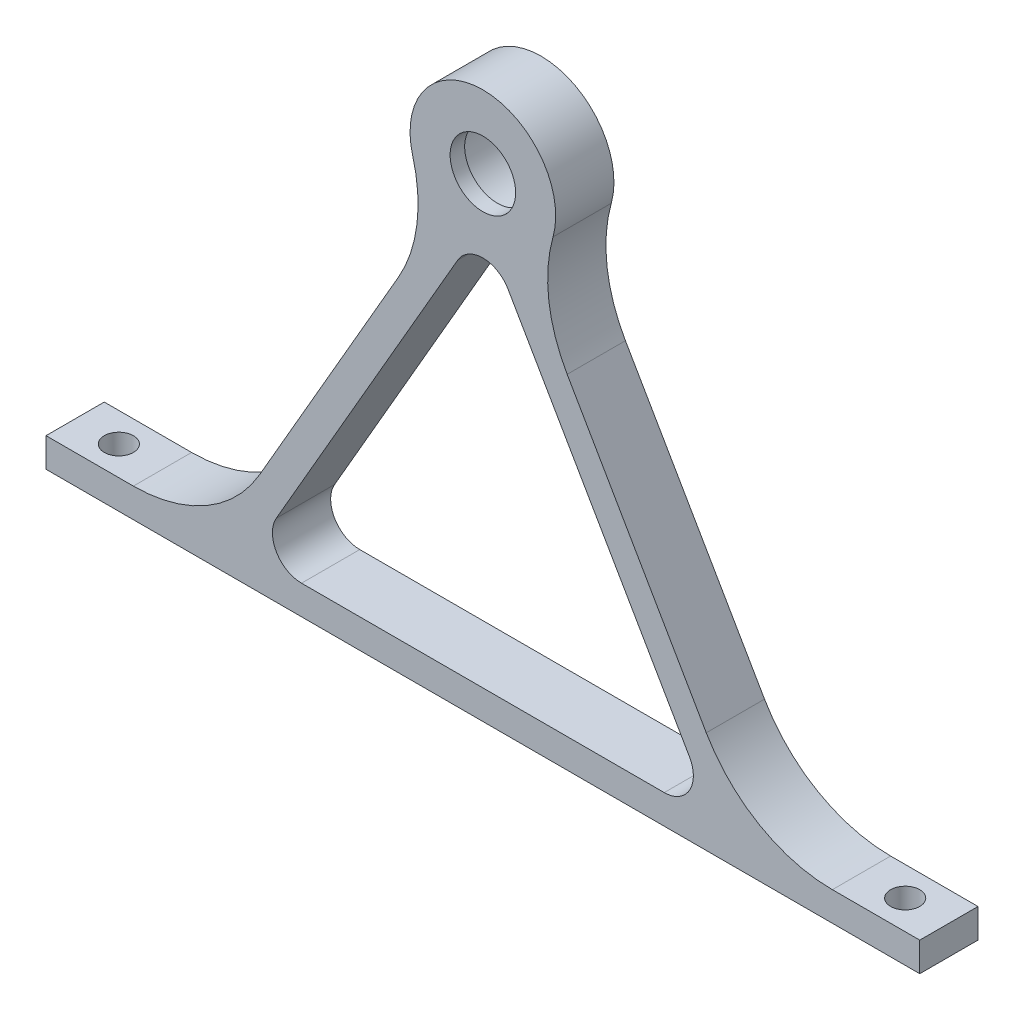
ISO-10303-21;
HEADER;
FILE_DESCRIPTION(('STEP AP214'),'2;1');
FILE_NAME('part.step','',(''),(''),'','','');
FILE_SCHEMA(('AUTOMOTIVE_DESIGN { 1 0 10303 214 1 1 1 1 }'));
ENDSEC;
DATA;
#1=APPLICATION_CONTEXT('core data for automotive mechanical design processes');
#2=APPLICATION_PROTOCOL_DEFINITION('international standard','automotive_design',2000,#1);
#3=PRODUCT_CONTEXT('',#1,'mechanical');
#4=PRODUCT('Part','Part','',(#3));
#5=PRODUCT_RELATED_PRODUCT_CATEGORY('part','',(#4));
#6=PRODUCT_DEFINITION_FORMATION('','',#4);
#7=PRODUCT_DEFINITION_CONTEXT('part definition',#1,'design');
#8=PRODUCT_DEFINITION('design','',#6,#7);
#9=PRODUCT_DEFINITION_SHAPE('','',#8);
#10=(LENGTH_UNIT() NAMED_UNIT(*) SI_UNIT(.MILLI.,.METRE.));
#11=(NAMED_UNIT(*) PLANE_ANGLE_UNIT() SI_UNIT($,.RADIAN.));
#12=(NAMED_UNIT(*) SI_UNIT($,.STERADIAN.) SOLID_ANGLE_UNIT());
#13=UNCERTAINTY_MEASURE_WITH_UNIT(LENGTH_MEASURE(1.E-05),#10,'distance_accuracy_value','');
#14=(GEOMETRIC_REPRESENTATION_CONTEXT(3) GLOBAL_UNCERTAINTY_ASSIGNED_CONTEXT((#13)) GLOBAL_UNIT_ASSIGNED_CONTEXT((#10,
#11,#12)) REPRESENTATION_CONTEXT('',''));
#15=CARTESIAN_POINT('',(0.,0.,0.));
#16=DIRECTION('',(0.,0.,1.));
#17=DIRECTION('',(1.,0.,0.));
#18=AXIS2_PLACEMENT_3D('',#15,#16,#17);
#19=CARTESIAN_POINT('',(0.,32.5692193816532,4.));
#20=DIRECTION('',(0.,0.,-1.));
#21=DIRECTION('',(-1.,0.,0.));
#22=AXIS2_PLACEMENT_3D('',#19,#20,#21);
#23=CYLINDRICAL_SURFACE('',#22,3.);
#24=CARTESIAN_POINT('',(0.,32.5692193816532,0.));
#25=DIRECTION('',(0.,0.,1.));
#26=DIRECTION('',(1.,0.,0.));
#27=AXIS2_PLACEMENT_3D('',#24,#25,#26);
#28=CIRCLE('',#27,3.);
#29=CARTESIAN_POINT('',(3.,32.5692193816532,0.));
#30=VERTEX_POINT('',#29);
#31=EDGE_CURVE('E283',#30,#30,#28,.T.);
#32=ORIENTED_EDGE('',*,*,#31,.F.);
#33=EDGE_LOOP('',(#32));
#34=FACE_BOUND('',#33,.T.);
#35=CARTESIAN_POINT('',(0.,32.5692193816532,3.));
#36=DIRECTION('',(0.,0.,1.));
#37=DIRECTION('',(1.,0.,0.));
#38=AXIS2_PLACEMENT_3D('',#35,#36,#37);
#39=CIRCLE('',#38,3.);
#40=CARTESIAN_POINT('',(3.,32.5692193816532,3.));
#41=VERTEX_POINT('',#40);
#42=EDGE_CURVE('E461',#41,#41,#39,.T.);
#43=ORIENTED_EDGE('',*,*,#42,.T.);
#44=EDGE_LOOP('',(#43));
#45=FACE_BOUND('',#44,.T.);
#46=ADVANCED_FACE('F132',(#34,#45),#23,.F.);
#47=CARTESIAN_POINT('',(24.,12.,4.));
#48=DIRECTION('',(0.,0.,-1.));
#49=DIRECTION('',(-1.,0.,0.));
#50=AXIS2_PLACEMENT_3D('',#47,#48,#49);
#51=PLANE('',#50);
#52=CARTESIAN_POINT('',(0.,25.5692193816532,4.));
#53=DIRECTION('',(0.,0.,-1.));
#54=DIRECTION('',(-1.,0.,0.));
#55=AXIS2_PLACEMENT_3D('',#52,#53,#54);
#56=CIRCLE('',#55,2.00000000000001);
#57=CARTESIAN_POINT('',(-1.73205080756888,26.5692193816532,4.));
#58=VERTEX_POINT('',#57);
#59=CARTESIAN_POINT('',(1.73205080756888,26.5692193816532,4.));
#60=VERTEX_POINT('',#59);
#61=EDGE_CURVE('E261',#58,#60,#56,.T.);
#62=ORIENTED_EDGE('',*,*,#61,.T.);
#63=DIRECTION('',(-0.499999999999997,0.86602540378444,0.));
#64=VECTOR('',#63,1.);
#65=CARTESIAN_POINT('',(14.1850454237764,5.,4.));
#66=LINE('',#65,#64);
#67=CARTESIAN_POINT('',(14.1850454237764,5.,4.));
#68=VERTEX_POINT('',#67);
#69=EDGE_CURVE('E265',#68,#60,#66,.T.);
#70=ORIENTED_EDGE('',*,*,#69,.F.);
#71=CARTESIAN_POINT('',(12.4529946162075,4.,4.));
#72=DIRECTION('',(0.,0.,1.));
#73=DIRECTION('',(1.,0.,0.));
#74=AXIS2_PLACEMENT_3D('',#71,#72,#73);
#75=CIRCLE('',#74,2.);
#76=CARTESIAN_POINT('',(12.4529946162075,2.,4.));
#77=VERTEX_POINT('',#76);
#78=EDGE_CURVE('E273',#77,#68,#75,.T.);
#79=ORIENTED_EDGE('',*,*,#78,.F.);
#80=DIRECTION('',(1.,0.,0.));
#81=VECTOR('',#80,1.);
#82=CARTESIAN_POINT('',(-12.4529946162075,2.,4.));
#83=LINE('',#82,#81);
#84=CARTESIAN_POINT('',(-12.4529946162075,2.,4.));
#85=VERTEX_POINT('',#84);
#86=EDGE_CURVE('E488',#85,#77,#83,.T.);
#87=ORIENTED_EDGE('',*,*,#86,.F.);
#88=CARTESIAN_POINT('',(-12.4529946162075,4.,4.));
#89=DIRECTION('',(0.,0.,-1.));
#90=DIRECTION('',(-1.,0.,0.));
#91=AXIS2_PLACEMENT_3D('',#88,#89,#90);
#92=CIRCLE('',#91,2.);
#93=CARTESIAN_POINT('',(-14.1850454237764,5.,4.));
#94=VERTEX_POINT('',#93);
#95=EDGE_CURVE('E279',#85,#94,#92,.T.);
#96=ORIENTED_EDGE('',*,*,#95,.T.);
#97=DIRECTION('',(-0.499999999999998,-0.86602540378444,0.));
#98=VECTOR('',#97,1.);
#99=CARTESIAN_POINT('',(-1.73205080756888,26.5692193816532,4.));
#100=LINE('',#99,#98);
#101=EDGE_CURVE('E267',#58,#94,#100,.T.);
#102=ORIENTED_EDGE('',*,*,#101,.F.);
#103=EDGE_LOOP('',(#62,#70,#79,#87,#96,#102));
#104=FACE_BOUND('',#103,.T.);
#105=CARTESIAN_POINT('',(14.4493380611437,28.5422317240134,4.));
#106=DIRECTION('',(0.,0.,-1.));
#107=DIRECTION('',(-1.,0.,0.));
#108=AXIS2_PLACEMENT_3D('',#105,#106,#107);
#109=CIRCLE('',#108,10.);
#110=CARTESIAN_POINT('',(5.78908402329934,23.5422317240135,4.));
#111=VERTEX_POINT('',#110);
#112=CARTESIAN_POINT('',(4.81644602038124,31.2268901624399,4.));
#113=VERTEX_POINT('',#112);
#114=EDGE_CURVE('E318',#111,#113,#109,.T.);
#115=ORIENTED_EDGE('',*,*,#114,.T.);
#116=CARTESIAN_POINT('',(0.,32.5692193816532,4.));
#117=DIRECTION('',(0.,0.,-1.));
#118=DIRECTION('',(-1.,0.,0.));
#119=AXIS2_PLACEMENT_3D('',#116,#117,#118);
#120=CIRCLE('',#119,5.);
#121=CARTESIAN_POINT('',(-4.81644602038125,31.2268901624399,4.));
#122=VERTEX_POINT('',#121);
#123=EDGE_CURVE('E315',#122,#113,#120,.T.);
#124=ORIENTED_EDGE('',*,*,#123,.F.);
#125=CARTESIAN_POINT('',(-14.4493380611437,28.5422317240134,4.));
#126=DIRECTION('',(0.,0.,1.));
#127=DIRECTION('',(1.,0.,0.));
#128=AXIS2_PLACEMENT_3D('',#125,#126,#127);
#129=CIRCLE('',#128,10.);
#130=CARTESIAN_POINT('',(-5.78908402329934,23.5422317240135,4.));
#131=VERTEX_POINT('',#130);
#132=EDGE_CURVE('E312',#131,#122,#129,.T.);
#133=ORIENTED_EDGE('',*,*,#132,.F.);
#134=DIRECTION('',(0.499999999999998,0.86602540378444,0.));
#135=VECTOR('',#134,1.);
#136=CARTESIAN_POINT('',(-15.3397459621556,7.00000000000002,4.));
#137=LINE('',#136,#135);
#138=CARTESIAN_POINT('',(-15.3397459621556,7.00000000000002,4.));
#139=VERTEX_POINT('',#138);
#140=EDGE_CURVE('E309',#139,#131,#137,.T.);
#141=ORIENTED_EDGE('',*,*,#140,.F.);
#142=CARTESIAN_POINT('',(-24.,12.,4.));
#143=DIRECTION('',(0.,0.,-1.));
#144=DIRECTION('',(-1.,0.,0.));
#145=AXIS2_PLACEMENT_3D('',#142,#143,#144);
#146=CIRCLE('',#145,10.);
#147=CARTESIAN_POINT('',(-24.,2.,4.));
#148=VERTEX_POINT('',#147);
#149=EDGE_CURVE('E307',#139,#148,#146,.T.);
#150=ORIENTED_EDGE('',*,*,#149,.T.);
#151=DIRECTION('',(1.,0.,0.));
#152=VECTOR('',#151,1.);
#153=CARTESIAN_POINT('',(-30.,2.,4.));
#154=LINE('',#153,#152);
#155=CARTESIAN_POINT('',(-30.,2.,4.));
#156=VERTEX_POINT('',#155);
#157=EDGE_CURVE('E304',#156,#148,#154,.T.);
#158=ORIENTED_EDGE('',*,*,#157,.F.);
#159=DIRECTION('',(0.,1.,0.));
#160=VECTOR('',#159,1.);
#161=CARTESIAN_POINT('',(-30.,0.,4.));
#162=LINE('',#161,#160);
#163=CARTESIAN_POINT('',(-30.,0.,4.));
#164=VERTEX_POINT('',#163);
#165=EDGE_CURVE('E301',#164,#156,#162,.T.);
#166=ORIENTED_EDGE('',*,*,#165,.F.);
#167=DIRECTION('',(1.,0.,0.));
#168=VECTOR('',#167,1.);
#169=CARTESIAN_POINT('',(-30.,0.,4.));
#170=LINE('',#169,#168);
#171=CARTESIAN_POINT('',(30.,0.,4.));
#172=VERTEX_POINT('',#171);
#173=EDGE_CURVE('E299',#164,#172,#170,.T.);
#174=ORIENTED_EDGE('',*,*,#173,.T.);
#175=DIRECTION('',(0.,1.,0.));
#176=VECTOR('',#175,1.);
#177=CARTESIAN_POINT('',(30.,0.,4.));
#178=LINE('',#177,#176);
#179=CARTESIAN_POINT('',(30.,2.,4.));
#180=VERTEX_POINT('',#179);
#181=EDGE_CURVE('E297',#172,#180,#178,.T.);
#182=ORIENTED_EDGE('',*,*,#181,.T.);
#183=DIRECTION('',(1.,0.,0.));
#184=VECTOR('',#183,1.);
#185=CARTESIAN_POINT('',(24.,2.,4.));
#186=LINE('',#185,#184);
#187=CARTESIAN_POINT('',(24.,2.,4.));
#188=VERTEX_POINT('',#187);
#189=EDGE_CURVE('E294',#188,#180,#186,.T.);
#190=ORIENTED_EDGE('',*,*,#189,.F.);
#191=CARTESIAN_POINT('',(24.,12.,4.));
#192=DIRECTION('',(0.,0.,-1.));
#193=DIRECTION('',(-1.,0.,0.));
#194=AXIS2_PLACEMENT_3D('',#191,#192,#193);
#195=CIRCLE('',#194,10.);
#196=CARTESIAN_POINT('',(15.3397459621556,7.00000000000002,4.));
#197=VERTEX_POINT('',#196);
#198=EDGE_CURVE('E291',#188,#197,#195,.T.);
#199=ORIENTED_EDGE('',*,*,#198,.T.);
#200=DIRECTION('',(0.499999999999998,-0.86602540378444,0.));
#201=VECTOR('',#200,1.);
#202=CARTESIAN_POINT('',(5.78908402329933,23.5422317240135,4.));
#203=LINE('',#202,#201);
#204=EDGE_CURVE('E288',#111,#197,#203,.T.);
#205=ORIENTED_EDGE('',*,*,#204,.F.);
#206=EDGE_LOOP('',(#115,#124,#133,#141,#150,#158,#166,#174,#182,#190,#199,#205));
#207=FACE_BOUND('',#206,.T.);
#208=CARTESIAN_POINT('',(0.,32.5692193816532,4.));
#209=DIRECTION('',(0.,0.,1.));
#210=DIRECTION('',(1.,0.,0.));
#211=AXIS2_PLACEMENT_3D('',#208,#209,#210);
#212=CIRCLE('',#211,2.25);
#213=CARTESIAN_POINT('',(2.25,32.5692193816532,4.));
#214=VERTEX_POINT('',#213);
#215=EDGE_CURVE('E498',#214,#214,#212,.T.);
#216=ORIENTED_EDGE('',*,*,#215,.F.);
#217=EDGE_LOOP('',(#216));
#218=FACE_BOUND('',#217,.T.);
#219=ADVANCED_FACE('F262',(#104,#207,#218),#51,.F.);
#220=CARTESIAN_POINT('',(24.,12.,0.));
#221=DIRECTION('',(0.,0.,-1.));
#222=DIRECTION('',(-1.,0.,0.));
#223=AXIS2_PLACEMENT_3D('',#220,#221,#222);
#224=PLANE('',#223);
#225=CARTESIAN_POINT('',(0.,25.5692193816532,0.));
#226=DIRECTION('',(0.,0.,-1.));
#227=DIRECTION('',(-1.,0.,0.));
#228=AXIS2_PLACEMENT_3D('',#225,#226,#227);
#229=CIRCLE('',#228,2.00000000000001);
#230=CARTESIAN_POINT('',(-1.73205080756888,26.5692193816532,0.));
#231=VERTEX_POINT('',#230);
#232=CARTESIAN_POINT('',(1.73205080756889,26.5692193816532,0.));
#233=VERTEX_POINT('',#232);
#234=EDGE_CURVE('E157',#231,#233,#229,.T.);
#235=ORIENTED_EDGE('',*,*,#234,.F.);
#236=DIRECTION('',(-0.499999999999998,-0.86602540378444,0.));
#237=VECTOR('',#236,1.);
#238=CARTESIAN_POINT('',(-1.73205080756888,26.5692193816532,0.));
#239=LINE('',#238,#237);
#240=CARTESIAN_POINT('',(-14.1850454237764,5.,0.));
#241=VERTEX_POINT('',#240);
#242=EDGE_CURVE('E268',#231,#241,#239,.T.);
#243=ORIENTED_EDGE('',*,*,#242,.T.);
#244=CARTESIAN_POINT('',(-12.4529946162075,4.,0.));
#245=DIRECTION('',(0.,0.,-1.));
#246=DIRECTION('',(-1.,0.,0.));
#247=AXIS2_PLACEMENT_3D('',#244,#245,#246);
#248=CIRCLE('',#247,2.);
#249=CARTESIAN_POINT('',(-12.4529946162075,2.,0.));
#250=VERTEX_POINT('',#249);
#251=EDGE_CURVE('E474',#250,#241,#248,.T.);
#252=ORIENTED_EDGE('',*,*,#251,.F.);
#253=DIRECTION('',(1.,0.,0.));
#254=VECTOR('',#253,1.);
#255=CARTESIAN_POINT('',(-12.4529946162075,2.,0.));
#256=LINE('',#255,#254);
#257=CARTESIAN_POINT('',(12.4529946162075,2.,0.));
#258=VERTEX_POINT('',#257);
#259=EDGE_CURVE('E471',#250,#258,#256,.T.);
#260=ORIENTED_EDGE('',*,*,#259,.T.);
#261=CARTESIAN_POINT('',(12.4529946162075,4.,0.));
#262=DIRECTION('',(0.,0.,1.));
#263=DIRECTION('',(1.,0.,0.));
#264=AXIS2_PLACEMENT_3D('',#261,#262,#263);
#265=CIRCLE('',#264,2.);
#266=CARTESIAN_POINT('',(14.1850454237764,5.,0.));
#267=VERTEX_POINT('',#266);
#268=EDGE_CURVE('E463',#258,#267,#265,.T.);
#269=ORIENTED_EDGE('',*,*,#268,.T.);
#270=DIRECTION('',(-0.499999999999997,0.86602540378444,0.));
#271=VECTOR('',#270,1.);
#272=CARTESIAN_POINT('',(14.1850454237764,5.,0.));
#273=LINE('',#272,#271);
#274=EDGE_CURVE('E460',#267,#233,#273,.T.);
#275=ORIENTED_EDGE('',*,*,#274,.T.);
#276=EDGE_LOOP('',(#235,#243,#252,#260,#269,#275));
#277=FACE_BOUND('',#276,.T.);
#278=DIRECTION('',(0.499999999999998,-0.86602540378444,0.));
#279=VECTOR('',#278,1.);
#280=CARTESIAN_POINT('',(5.78908402329933,23.5422317240135,0.));
#281=LINE('',#280,#279);
#282=CARTESIAN_POINT('',(5.78908402329934,23.5422317240135,0.));
#283=VERTEX_POINT('',#282);
#284=CARTESIAN_POINT('',(15.3397459621556,7.00000000000002,0.));
#285=VERTEX_POINT('',#284);
#286=EDGE_CURVE('E286',#283,#285,#281,.T.);
#287=ORIENTED_EDGE('',*,*,#286,.T.);
#288=CARTESIAN_POINT('',(24.,12.,0.));
#289=DIRECTION('',(0.,0.,-1.));
#290=DIRECTION('',(-1.,0.,0.));
#291=AXIS2_PLACEMENT_3D('',#288,#289,#290);
#292=CIRCLE('',#291,10.);
#293=CARTESIAN_POINT('',(24.,2.,0.));
#294=VERTEX_POINT('',#293);
#295=EDGE_CURVE('E323',#294,#285,#292,.T.);
#296=ORIENTED_EDGE('',*,*,#295,.F.);
#297=DIRECTION('',(1.,0.,0.));
#298=VECTOR('',#297,1.);
#299=CARTESIAN_POINT('',(24.,2.,0.));
#300=LINE('',#299,#298);
#301=CARTESIAN_POINT('',(30.,2.,0.));
#302=VERTEX_POINT('',#301);
#303=EDGE_CURVE('E326',#294,#302,#300,.T.);
#304=ORIENTED_EDGE('',*,*,#303,.T.);
#305=DIRECTION('',(0.,1.,0.));
#306=VECTOR('',#305,1.);
#307=CARTESIAN_POINT('',(30.,0.,0.));
#308=LINE('',#307,#306);
#309=CARTESIAN_POINT('',(30.,0.,0.));
#310=VERTEX_POINT('',#309);
#311=EDGE_CURVE('E329',#310,#302,#308,.T.);
#312=ORIENTED_EDGE('',*,*,#311,.F.);
#313=DIRECTION('',(1.,0.,0.));
#314=VECTOR('',#313,1.);
#315=CARTESIAN_POINT('',(-30.,0.,0.));
#316=LINE('',#315,#314);
#317=CARTESIAN_POINT('',(-30.,0.,0.));
#318=VERTEX_POINT('',#317);
#319=EDGE_CURVE('E332',#318,#310,#316,.T.);
#320=ORIENTED_EDGE('',*,*,#319,.F.);
#321=DIRECTION('',(0.,1.,0.));
#322=VECTOR('',#321,1.);
#323=CARTESIAN_POINT('',(-30.,0.,0.));
#324=LINE('',#323,#322);
#325=CARTESIAN_POINT('',(-30.,2.,0.));
#326=VERTEX_POINT('',#325);
#327=EDGE_CURVE('E334',#318,#326,#324,.T.);
#328=ORIENTED_EDGE('',*,*,#327,.T.);
#329=DIRECTION('',(1.,0.,0.));
#330=VECTOR('',#329,1.);
#331=CARTESIAN_POINT('',(-30.,2.,0.));
#332=LINE('',#331,#330);
#333=CARTESIAN_POINT('',(-24.,2.,0.));
#334=VERTEX_POINT('',#333);
#335=EDGE_CURVE('E337',#326,#334,#332,.T.);
#336=ORIENTED_EDGE('',*,*,#335,.T.);
#337=CARTESIAN_POINT('',(-24.,12.,0.));
#338=DIRECTION('',(0.,0.,-1.));
#339=DIRECTION('',(-1.,0.,0.));
#340=AXIS2_PLACEMENT_3D('',#337,#338,#339);
#341=CIRCLE('',#340,10.);
#342=CARTESIAN_POINT('',(-15.3397459621556,7.00000000000002,0.));
#343=VERTEX_POINT('',#342);
#344=EDGE_CURVE('E340',#343,#334,#341,.T.);
#345=ORIENTED_EDGE('',*,*,#344,.F.);
#346=DIRECTION('',(0.499999999999998,0.86602540378444,0.));
#347=VECTOR('',#346,1.);
#348=CARTESIAN_POINT('',(-15.3397459621556,7.00000000000002,0.));
#349=LINE('',#348,#347);
#350=CARTESIAN_POINT('',(-5.78908402329934,23.5422317240135,0.));
#351=VERTEX_POINT('',#350);
#352=EDGE_CURVE('E343',#343,#351,#349,.T.);
#353=ORIENTED_EDGE('',*,*,#352,.T.);
#354=CARTESIAN_POINT('',(-14.4493380611437,28.5422317240134,0.));
#355=DIRECTION('',(0.,0.,1.));
#356=DIRECTION('',(1.,0.,0.));
#357=AXIS2_PLACEMENT_3D('',#354,#355,#356);
#358=CIRCLE('',#357,10.);
#359=CARTESIAN_POINT('',(-4.81644602038125,31.2268901624399,0.));
#360=VERTEX_POINT('',#359);
#361=EDGE_CURVE('E346',#351,#360,#358,.T.);
#362=ORIENTED_EDGE('',*,*,#361,.T.);
#363=CARTESIAN_POINT('',(0.,32.5692193816532,0.));
#364=DIRECTION('',(0.,0.,-1.));
#365=DIRECTION('',(-1.,0.,0.));
#366=AXIS2_PLACEMENT_3D('',#363,#364,#365);
#367=CIRCLE('',#366,5.);
#368=CARTESIAN_POINT('',(4.81644602038124,31.2268901624399,0.));
#369=VERTEX_POINT('',#368);
#370=EDGE_CURVE('E349',#360,#369,#367,.T.);
#371=ORIENTED_EDGE('',*,*,#370,.T.);
#372=CARTESIAN_POINT('',(14.4493380611437,28.5422317240134,0.));
#373=DIRECTION('',(0.,0.,-1.));
#374=DIRECTION('',(-1.,0.,0.));
#375=AXIS2_PLACEMENT_3D('',#372,#373,#374);
#376=CIRCLE('',#375,10.);
#377=EDGE_CURVE('E292',#283,#369,#376,.T.);
#378=ORIENTED_EDGE('',*,*,#377,.F.);
#379=EDGE_LOOP('',(#287,#296,#304,#312,#320,#328,#336,#345,#353,#362,#371,#378));
#380=FACE_BOUND('',#379,.T.);
#381=ORIENTED_EDGE('',*,*,#31,.T.);
#382=EDGE_LOOP('',(#381));
#383=FACE_BOUND('',#382,.T.);
#384=ADVANCED_FACE('F384',(#277,#380,#383),#224,.T.);
#385=CARTESIAN_POINT('',(5.78908402329933,23.5422317240135,4.));
#386=DIRECTION('',(0.86602540378444,0.499999999999998,0.));
#387=DIRECTION('',(-0.499999999999998,0.86602540378444,0.));
#388=AXIS2_PLACEMENT_3D('',#385,#386,#387);
#389=PLANE('',#388);
#390=ORIENTED_EDGE('',*,*,#286,.F.);
#391=DIRECTION('',(0.,0.,-1.));
#392=VECTOR('',#391,1.);
#393=CARTESIAN_POINT('',(5.78908402329934,23.5422317240135,4.));
#394=LINE('',#393,#392);
#395=EDGE_CURVE('E12',#111,#283,#394,.T.);
#396=ORIENTED_EDGE('',*,*,#395,.F.);
#397=ORIENTED_EDGE('',*,*,#204,.T.);
#398=DIRECTION('',(0.,0.,-1.));
#399=VECTOR('',#398,1.);
#400=CARTESIAN_POINT('',(15.3397459621556,7.00000000000002,4.));
#401=LINE('',#400,#399);
#402=EDGE_CURVE('E320',#197,#285,#401,.T.);
#403=ORIENTED_EDGE('',*,*,#402,.T.);
#404=EDGE_LOOP('',(#390,#396,#397,#403));
#405=FACE_BOUND('',#404,.T.);
#406=ADVANCED_FACE('F134',(#405),#389,.T.);
#407=CARTESIAN_POINT('',(14.4493380611437,28.5422317240134,4.));
#408=DIRECTION('',(0.,0.,-1.));
#409=DIRECTION('',(-1.,0.,0.));
#410=AXIS2_PLACEMENT_3D('',#407,#408,#409);
#411=CYLINDRICAL_SURFACE('',#410,10.);
#412=ORIENTED_EDGE('',*,*,#377,.T.);
#413=DIRECTION('',(0.,0.,-1.));
#414=VECTOR('',#413,1.);
#415=CARTESIAN_POINT('',(4.81644602038124,31.2268901624399,4.));
#416=LINE('',#415,#414);
#417=EDGE_CURVE('E141',#113,#369,#416,.T.);
#418=ORIENTED_EDGE('',*,*,#417,.F.);
#419=ORIENTED_EDGE('',*,*,#114,.F.);
#420=ORIENTED_EDGE('',*,*,#395,.T.);
#421=EDGE_LOOP('',(#412,#418,#419,#420));
#422=FACE_BOUND('',#421,.T.);
#423=ADVANCED_FACE('F389',(#422),#411,.F.);
#424=CARTESIAN_POINT('',(0.,32.5692193816532,4.));
#425=DIRECTION('',(0.,0.,-1.));
#426=DIRECTION('',(-1.,0.,0.));
#427=AXIS2_PLACEMENT_3D('',#424,#425,#426);
#428=CYLINDRICAL_SURFACE('',#427,5.);
#429=ORIENTED_EDGE('',*,*,#417,.T.);
#430=ORIENTED_EDGE('',*,*,#370,.F.);
#431=DIRECTION('',(0.,0.,-1.));
#432=VECTOR('',#431,1.);
#433=CARTESIAN_POINT('',(-4.81644602038125,31.2268901624399,4.));
#434=LINE('',#433,#432);
#435=EDGE_CURVE('E355',#122,#360,#434,.T.);
#436=ORIENTED_EDGE('',*,*,#435,.F.);
#437=ORIENTED_EDGE('',*,*,#123,.T.);
#438=EDGE_LOOP('',(#429,#430,#436,#437));
#439=FACE_BOUND('',#438,.T.);
#440=ADVANCED_FACE('F428',(#439),#428,.T.);
#441=CARTESIAN_POINT('',(-14.4493380611437,28.5422317240134,4.));
#442=DIRECTION('',(0.,0.,-1.));
#443=DIRECTION('',(-1.,0.,0.));
#444=AXIS2_PLACEMENT_3D('',#441,#442,#443);
#445=CYLINDRICAL_SURFACE('',#444,10.);
#446=ORIENTED_EDGE('',*,*,#361,.F.);
#447=DIRECTION('',(0.,0.,-1.));
#448=VECTOR('',#447,1.);
#449=CARTESIAN_POINT('',(-5.78908402329934,23.5422317240135,4.));
#450=LINE('',#449,#448);
#451=EDGE_CURVE('E357',#131,#351,#450,.T.);
#452=ORIENTED_EDGE('',*,*,#451,.F.);
#453=ORIENTED_EDGE('',*,*,#132,.T.);
#454=ORIENTED_EDGE('',*,*,#435,.T.);
#455=EDGE_LOOP('',(#446,#452,#453,#454));
#456=FACE_BOUND('',#455,.T.);
#457=ADVANCED_FACE('F425',(#456),#445,.F.);
#458=CARTESIAN_POINT('',(-15.3397459621556,7.00000000000002,4.));
#459=DIRECTION('',(-0.86602540378444,0.499999999999998,0.));
#460=DIRECTION('',(-0.499999999999998,-0.86602540378444,0.));
#461=AXIS2_PLACEMENT_3D('',#458,#459,#460);
#462=PLANE('',#461);
#463=ORIENTED_EDGE('',*,*,#352,.F.);
#464=DIRECTION('',(0.,0.,-1.));
#465=VECTOR('',#464,1.);
#466=CARTESIAN_POINT('',(-15.3397459621556,7.00000000000002,4.));
#467=LINE('',#466,#465);
#468=EDGE_CURVE('E359',#139,#343,#467,.T.);
#469=ORIENTED_EDGE('',*,*,#468,.F.);
#470=ORIENTED_EDGE('',*,*,#140,.T.);
#471=ORIENTED_EDGE('',*,*,#451,.T.);
#472=EDGE_LOOP('',(#463,#469,#470,#471));
#473=FACE_BOUND('',#472,.T.);
#474=ADVANCED_FACE('F422',(#473),#462,.T.);
#475=CARTESIAN_POINT('',(-24.,12.,4.));
#476=DIRECTION('',(0.,0.,-1.));
#477=DIRECTION('',(-1.,0.,0.));
#478=AXIS2_PLACEMENT_3D('',#475,#476,#477);
#479=CYLINDRICAL_SURFACE('',#478,10.);
#480=ORIENTED_EDGE('',*,*,#344,.T.);
#481=DIRECTION('',(0.,0.,-1.));
#482=VECTOR('',#481,1.);
#483=CARTESIAN_POINT('',(-24.,2.,4.));
#484=LINE('',#483,#482);
#485=EDGE_CURVE('E361',#148,#334,#484,.T.);
#486=ORIENTED_EDGE('',*,*,#485,.F.);
#487=ORIENTED_EDGE('',*,*,#149,.F.);
#488=ORIENTED_EDGE('',*,*,#468,.T.);
#489=EDGE_LOOP('',(#480,#486,#487,#488));
#490=FACE_BOUND('',#489,.T.);
#491=ADVANCED_FACE('F419',(#490),#479,.F.);
#492=CARTESIAN_POINT('',(-30.,2.,4.));
#493=DIRECTION('',(0.,1.,0.));
#494=DIRECTION('',(-1.,0.,0.));
#495=AXIS2_PLACEMENT_3D('',#492,#493,#494);
#496=PLANE('',#495);
#497=CARTESIAN_POINT('',(-27.,2.,2.00000000000001));
#498=DIRECTION('',(0.,1.,0.));
#499=DIRECTION('',(-1.,0.,0.));
#500=AXIS2_PLACEMENT_3D('',#497,#498,#499);
#501=CIRCLE('',#500,1.);
#502=CARTESIAN_POINT('',(-28.,2.,2.00000000000001));
#503=VERTEX_POINT('',#502);
#504=EDGE_CURVE('E506',#503,#503,#501,.T.);
#505=ORIENTED_EDGE('',*,*,#504,.F.);
#506=EDGE_LOOP('',(#505));
#507=FACE_BOUND('',#506,.T.);
#508=ORIENTED_EDGE('',*,*,#335,.F.);
#509=DIRECTION('',(0.,0.,-1.));
#510=VECTOR('',#509,1.);
#511=CARTESIAN_POINT('',(-30.,2.,4.));
#512=LINE('',#511,#510);
#513=EDGE_CURVE('E363',#156,#326,#512,.T.);
#514=ORIENTED_EDGE('',*,*,#513,.F.);
#515=ORIENTED_EDGE('',*,*,#157,.T.);
#516=ORIENTED_EDGE('',*,*,#485,.T.);
#517=EDGE_LOOP('',(#508,#514,#515,#516));
#518=FACE_BOUND('',#517,.T.);
#519=ADVANCED_FACE('F414',(#507,#518),#496,.T.);
#520=CARTESIAN_POINT('',(-30.,0.,4.));
#521=DIRECTION('',(-1.,0.,0.));
#522=DIRECTION('',(0.,0.,1.));
#523=AXIS2_PLACEMENT_3D('',#520,#521,#522);
#524=PLANE('',#523);
#525=ORIENTED_EDGE('',*,*,#327,.F.);
#526=DIRECTION('',(0.,0.,-1.));
#527=VECTOR('',#526,1.);
#528=CARTESIAN_POINT('',(-30.,0.,4.));
#529=LINE('',#528,#527);
#530=EDGE_CURVE('E365',#164,#318,#529,.T.);
#531=ORIENTED_EDGE('',*,*,#530,.F.);
#532=ORIENTED_EDGE('',*,*,#165,.T.);
#533=ORIENTED_EDGE('',*,*,#513,.T.);
#534=EDGE_LOOP('',(#525,#531,#532,#533));
#535=FACE_BOUND('',#534,.T.);
#536=ADVANCED_FACE('F409',(#535),#524,.T.);
#537=CARTESIAN_POINT('',(-30.,0.,4.));
#538=DIRECTION('',(0.,1.,0.));
#539=DIRECTION('',(0.,0.,1.));
#540=AXIS2_PLACEMENT_3D('',#537,#538,#539);
#541=PLANE('',#540);
#542=CARTESIAN_POINT('',(-27.,0.,2.00000000000001));
#543=DIRECTION('',(0.,1.,0.));
#544=DIRECTION('',(0.,0.,1.));
#545=AXIS2_PLACEMENT_3D('',#542,#543,#544);
#546=CIRCLE('',#545,1.);
#547=CARTESIAN_POINT('',(-27.,0.,3.00000000000001));
#548=VERTEX_POINT('',#547);
#549=EDGE_CURVE('E509',#548,#548,#546,.T.);
#550=ORIENTED_EDGE('',*,*,#549,.T.);
#551=EDGE_LOOP('',(#550));
#552=FACE_BOUND('',#551,.T.);
#553=CARTESIAN_POINT('',(27.,0.,2.));
#554=DIRECTION('',(0.,1.,0.));
#555=DIRECTION('',(0.,0.,1.));
#556=AXIS2_PLACEMENT_3D('',#553,#554,#555);
#557=CIRCLE('',#556,1.);
#558=CARTESIAN_POINT('',(27.,0.,3.));
#559=VERTEX_POINT('',#558);
#560=EDGE_CURVE('E503',#559,#559,#557,.T.);
#561=ORIENTED_EDGE('',*,*,#560,.T.);
#562=EDGE_LOOP('',(#561));
#563=FACE_BOUND('',#562,.T.);
#564=ORIENTED_EDGE('',*,*,#319,.T.);
#565=DIRECTION('',(0.,0.,-1.));
#566=VECTOR('',#565,1.);
#567=CARTESIAN_POINT('',(30.,0.,4.));
#568=LINE('',#567,#566);
#569=EDGE_CURVE('E367',#172,#310,#568,.T.);
#570=ORIENTED_EDGE('',*,*,#569,.F.);
#571=ORIENTED_EDGE('',*,*,#173,.F.);
#572=ORIENTED_EDGE('',*,*,#530,.T.);
#573=EDGE_LOOP('',(#564,#570,#571,#572));
#574=FACE_BOUND('',#573,.T.);
#575=ADVANCED_FACE('F406',(#552,#563,#574),#541,.F.);
#576=CARTESIAN_POINT('',(30.,0.,4.));
#577=DIRECTION('',(-1.,0.,0.));
#578=DIRECTION('',(0.,0.,1.));
#579=AXIS2_PLACEMENT_3D('',#576,#577,#578);
#580=PLANE('',#579);
#581=ORIENTED_EDGE('',*,*,#311,.T.);
#582=DIRECTION('',(0.,0.,-1.));
#583=VECTOR('',#582,1.);
#584=CARTESIAN_POINT('',(30.,2.,4.));
#585=LINE('',#584,#583);
#586=EDGE_CURVE('E370',#180,#302,#585,.T.);
#587=ORIENTED_EDGE('',*,*,#586,.F.);
#588=ORIENTED_EDGE('',*,*,#181,.F.);
#589=ORIENTED_EDGE('',*,*,#569,.T.);
#590=EDGE_LOOP('',(#581,#587,#588,#589));
#591=FACE_BOUND('',#590,.T.);
#592=ADVANCED_FACE('F402',(#591),#580,.F.);
#593=CARTESIAN_POINT('',(24.,2.,4.));
#594=DIRECTION('',(0.,1.,0.));
#595=DIRECTION('',(0.,0.,1.));
#596=AXIS2_PLACEMENT_3D('',#593,#594,#595);
#597=PLANE('',#596);
#598=CARTESIAN_POINT('',(27.,2.,2.));
#599=DIRECTION('',(0.,1.,0.));
#600=DIRECTION('',(0.,0.,1.));
#601=AXIS2_PLACEMENT_3D('',#598,#599,#600);
#602=CIRCLE('',#601,1.);
#603=CARTESIAN_POINT('',(27.,2.,3.));
#604=VERTEX_POINT('',#603);
#605=EDGE_CURVE('E136',#604,#604,#602,.T.);
#606=ORIENTED_EDGE('',*,*,#605,.F.);
#607=EDGE_LOOP('',(#606));
#608=FACE_BOUND('',#607,.T.);
#609=ORIENTED_EDGE('',*,*,#303,.F.);
#610=DIRECTION('',(0.,0.,-1.));
#611=VECTOR('',#610,1.);
#612=CARTESIAN_POINT('',(24.,2.,4.));
#613=LINE('',#612,#611);
#614=EDGE_CURVE('E372',#188,#294,#613,.T.);
#615=ORIENTED_EDGE('',*,*,#614,.F.);
#616=ORIENTED_EDGE('',*,*,#189,.T.);
#617=ORIENTED_EDGE('',*,*,#586,.T.);
#618=EDGE_LOOP('',(#609,#615,#616,#617));
#619=FACE_BOUND('',#618,.T.);
#620=ADVANCED_FACE('F397',(#608,#619),#597,.T.);
#621=CARTESIAN_POINT('',(24.,12.,4.));
#622=DIRECTION('',(0.,0.,-1.));
#623=DIRECTION('',(-1.,0.,0.));
#624=AXIS2_PLACEMENT_3D('',#621,#622,#623);
#625=CYLINDRICAL_SURFACE('',#624,10.);
#626=ORIENTED_EDGE('',*,*,#295,.T.);
#627=ORIENTED_EDGE('',*,*,#402,.F.);
#628=ORIENTED_EDGE('',*,*,#198,.F.);
#629=ORIENTED_EDGE('',*,*,#614,.T.);
#630=EDGE_LOOP('',(#626,#627,#628,#629));
#631=FACE_BOUND('',#630,.T.);
#632=ADVANCED_FACE('F380',(#631),#625,.F.);
#633=CARTESIAN_POINT('',(0.,25.5692193816532,4.));
#634=DIRECTION('',(0.,0.,-1.));
#635=DIRECTION('',(-1.,0.,0.));
#636=AXIS2_PLACEMENT_3D('',#633,#634,#635);
#637=CYLINDRICAL_SURFACE('',#636,2.00000000000001);
#638=DIRECTION('',(0.,0.,-1.));
#639=VECTOR('',#638,1.);
#640=CARTESIAN_POINT('',(1.73205080756888,26.5692193816532,4.));
#641=LINE('',#640,#639);
#642=EDGE_CURVE('E271',#60,#233,#641,.T.);
#643=ORIENTED_EDGE('',*,*,#642,.F.);
#644=ORIENTED_EDGE('',*,*,#61,.F.);
#645=DIRECTION('',(0.,0.,-1.));
#646=VECTOR('',#645,1.);
#647=CARTESIAN_POINT('',(-1.73205080756888,26.5692193816532,4.));
#648=LINE('',#647,#646);
#649=EDGE_CURVE('E287',#58,#231,#648,.T.);
#650=ORIENTED_EDGE('',*,*,#649,.T.);
#651=ORIENTED_EDGE('',*,*,#234,.T.);
#652=EDGE_LOOP('',(#643,#644,#650,#651));
#653=FACE_BOUND('',#652,.T.);
#654=ADVANCED_FACE('F275',(#653),#637,.F.);
#655=CARTESIAN_POINT('',(-1.73205080756888,26.5692193816532,4.));
#656=DIRECTION('',(0.86602540378444,-0.499999999999998,0.));
#657=DIRECTION('',(0.499999999999998,0.86602540378444,0.));
#658=AXIS2_PLACEMENT_3D('',#655,#656,#657);
#659=PLANE('',#658);
#660=ORIENTED_EDGE('',*,*,#242,.F.);
#661=ORIENTED_EDGE('',*,*,#649,.F.);
#662=ORIENTED_EDGE('',*,*,#101,.T.);
#663=DIRECTION('',(0.,0.,-1.));
#664=VECTOR('',#663,1.);
#665=CARTESIAN_POINT('',(-14.1850454237764,5.,4.));
#666=LINE('',#665,#664);
#667=EDGE_CURVE('E479',#94,#241,#666,.T.);
#668=ORIENTED_EDGE('',*,*,#667,.T.);
#669=EDGE_LOOP('',(#660,#661,#662,#668));
#670=FACE_BOUND('',#669,.T.);
#671=ADVANCED_FACE('F534',(#670),#659,.T.);
#672=CARTESIAN_POINT('',(-12.4529946162075,4.,4.));
#673=DIRECTION('',(0.,0.,-1.));
#674=DIRECTION('',(-1.,0.,0.));
#675=AXIS2_PLACEMENT_3D('',#672,#673,#674);
#676=CYLINDRICAL_SURFACE('',#675,2.);
#677=ORIENTED_EDGE('',*,*,#251,.T.);
#678=ORIENTED_EDGE('',*,*,#667,.F.);
#679=ORIENTED_EDGE('',*,*,#95,.F.);
#680=DIRECTION('',(0.,0.,-1.));
#681=VECTOR('',#680,1.);
#682=CARTESIAN_POINT('',(-12.4529946162075,2.,4.));
#683=LINE('',#682,#681);
#684=EDGE_CURVE('E481',#85,#250,#683,.T.);
#685=ORIENTED_EDGE('',*,*,#684,.T.);
#686=EDGE_LOOP('',(#677,#678,#679,#685));
#687=FACE_BOUND('',#686,.T.);
#688=ADVANCED_FACE('F493',(#687),#676,.F.);
#689=CARTESIAN_POINT('',(-12.4529946162075,2.,4.));
#690=DIRECTION('',(0.,1.,0.));
#691=DIRECTION('',(0.,0.,1.));
#692=AXIS2_PLACEMENT_3D('',#689,#690,#691);
#693=PLANE('',#692);
#694=ORIENTED_EDGE('',*,*,#259,.F.);
#695=ORIENTED_EDGE('',*,*,#684,.F.);
#696=ORIENTED_EDGE('',*,*,#86,.T.);
#697=DIRECTION('',(0.,0.,-1.));
#698=VECTOR('',#697,1.);
#699=CARTESIAN_POINT('',(12.4529946162075,2.,4.));
#700=LINE('',#699,#698);
#701=EDGE_CURVE('E277',#77,#258,#700,.T.);
#702=ORIENTED_EDGE('',*,*,#701,.T.);
#703=EDGE_LOOP('',(#694,#695,#696,#702));
#704=FACE_BOUND('',#703,.T.);
#705=ADVANCED_FACE('F486',(#704),#693,.T.);
#706=CARTESIAN_POINT('',(12.4529946162075,4.,4.));
#707=DIRECTION('',(0.,0.,-1.));
#708=DIRECTION('',(-1.,0.,0.));
#709=AXIS2_PLACEMENT_3D('',#706,#707,#708);
#710=CYLINDRICAL_SURFACE('',#709,2.);
#711=ORIENTED_EDGE('',*,*,#268,.F.);
#712=ORIENTED_EDGE('',*,*,#701,.F.);
#713=ORIENTED_EDGE('',*,*,#78,.T.);
#714=DIRECTION('',(0.,0.,-1.));
#715=VECTOR('',#714,1.);
#716=CARTESIAN_POINT('',(14.1850454237764,5.,4.));
#717=LINE('',#716,#715);
#718=EDGE_CURVE('E149',#68,#267,#717,.T.);
#719=ORIENTED_EDGE('',*,*,#718,.T.);
#720=EDGE_LOOP('',(#711,#712,#713,#719));
#721=FACE_BOUND('',#720,.T.);
#722=ADVANCED_FACE('F490',(#721),#710,.F.);
#723=CARTESIAN_POINT('',(14.1850454237764,5.,4.));
#724=DIRECTION('',(-0.86602540378444,-0.499999999999997,0.));
#725=DIRECTION('',(0.499999999999997,-0.86602540378444,0.));
#726=AXIS2_PLACEMENT_3D('',#723,#724,#725);
#727=PLANE('',#726);
#728=ORIENTED_EDGE('',*,*,#274,.F.);
#729=ORIENTED_EDGE('',*,*,#718,.F.);
#730=ORIENTED_EDGE('',*,*,#69,.T.);
#731=ORIENTED_EDGE('',*,*,#642,.T.);
#732=EDGE_LOOP('',(#728,#729,#730,#731));
#733=FACE_BOUND('',#732,.T.);
#734=ADVANCED_FACE('F270',(#733),#727,.T.);
#735=CARTESIAN_POINT('',(0.,32.5692193816532,3.));
#736=DIRECTION('',(0.,0.,1.));
#737=DIRECTION('',(1.,0.,0.));
#738=AXIS2_PLACEMENT_3D('',#735,#736,#737);
#739=PLANE('',#738);
#740=ORIENTED_EDGE('',*,*,#42,.F.);
#741=EDGE_LOOP('',(#740));
#742=FACE_BOUND('',#741,.T.);
#743=CARTESIAN_POINT('',(0.,32.5692193816532,3.));
#744=DIRECTION('',(0.,0.,1.));
#745=DIRECTION('',(1.,0.,0.));
#746=AXIS2_PLACEMENT_3D('',#743,#744,#745);
#747=CIRCLE('',#746,2.25);
#748=CARTESIAN_POINT('',(2.25,32.5692193816532,3.));
#749=VERTEX_POINT('',#748);
#750=EDGE_CURVE('E466',#749,#749,#747,.T.);
#751=ORIENTED_EDGE('',*,*,#750,.T.);
#752=EDGE_LOOP('',(#751));
#753=FACE_BOUND('',#752,.T.);
#754=ADVANCED_FACE('F529',(#742,#753),#739,.F.);
#755=CARTESIAN_POINT('',(0.,32.5692193816532,3.));
#756=DIRECTION('',(0.,0.,1.));
#757=DIRECTION('',(1.,0.,0.));
#758=AXIS2_PLACEMENT_3D('',#755,#756,#757);
#759=CYLINDRICAL_SURFACE('',#758,2.25);
#760=ORIENTED_EDGE('',*,*,#750,.F.);
#761=EDGE_LOOP('',(#760));
#762=FACE_BOUND('',#761,.T.);
#763=ORIENTED_EDGE('',*,*,#215,.T.);
#764=EDGE_LOOP('',(#763));
#765=FACE_BOUND('',#764,.T.);
#766=ADVANCED_FACE('F523',(#762,#765),#759,.F.);
#767=CARTESIAN_POINT('',(27.,0.,2.));
#768=DIRECTION('',(0.,1.,0.));
#769=DIRECTION('',(0.,0.,1.));
#770=AXIS2_PLACEMENT_3D('',#767,#768,#769);
#771=CYLINDRICAL_SURFACE('',#770,1.);
#772=ORIENTED_EDGE('',*,*,#605,.T.);
#773=EDGE_LOOP('',(#772));
#774=FACE_BOUND('',#773,.T.);
#775=ORIENTED_EDGE('',*,*,#560,.F.);
#776=EDGE_LOOP('',(#775));
#777=FACE_BOUND('',#776,.T.);
#778=ADVANCED_FACE('F517',(#774,#777),#771,.F.);
#779=CARTESIAN_POINT('',(-27.,0.,2.00000000000001));
#780=DIRECTION('',(0.,1.,0.));
#781=DIRECTION('',(0.,0.,1.));
#782=AXIS2_PLACEMENT_3D('',#779,#780,#781);
#783=CYLINDRICAL_SURFACE('',#782,1.);
#784=ORIENTED_EDGE('',*,*,#504,.T.);
#785=EDGE_LOOP('',(#784));
#786=FACE_BOUND('',#785,.T.);
#787=ORIENTED_EDGE('',*,*,#549,.F.);
#788=EDGE_LOOP('',(#787));
#789=FACE_BOUND('',#788,.T.);
#790=ADVANCED_FACE('F515',(#786,#789),#783,.F.);
#791=CLOSED_SHELL('',(#46,#219,#384,#406,#423,#440,#457,#474,#491,#519,#536,#575,#592,#620,#632,
#654,#671,#688,#705,#722,#734,#754,#766,#778,#790));
#792=MANIFOLD_SOLID_BREP('B2',#791);
#793=ADVANCED_BREP_SHAPE_REPRESENTATION('',(#18,#792),#14);
#794=SHAPE_DEFINITION_REPRESENTATION(#9,#793);
ENDSEC;
END-ISO-10303-21;
